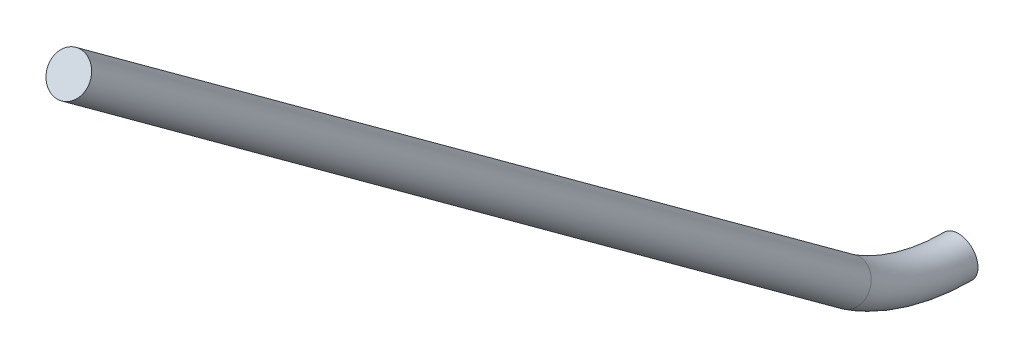
ISO-10303-21;
HEADER;
FILE_DESCRIPTION(('STEP AP214'),'2;1');
FILE_NAME('part.step','',(''),(''),'','','');
FILE_SCHEMA(('AUTOMOTIVE_DESIGN { 1 0 10303 214 1 1 1 1 }'));
ENDSEC;
DATA;
#1=APPLICATION_CONTEXT('core data for automotive mechanical design processes');
#2=APPLICATION_PROTOCOL_DEFINITION('international standard','automotive_design',2000,#1);
#3=PRODUCT_CONTEXT('',#1,'mechanical');
#4=PRODUCT('Part','Part','',(#3));
#5=PRODUCT_RELATED_PRODUCT_CATEGORY('part','',(#4));
#6=PRODUCT_DEFINITION_FORMATION('','',#4);
#7=PRODUCT_DEFINITION_CONTEXT('part definition',#1,'design');
#8=PRODUCT_DEFINITION('design','',#6,#7);
#9=PRODUCT_DEFINITION_SHAPE('','',#8);
#10=(LENGTH_UNIT() NAMED_UNIT(*) SI_UNIT(.MILLI.,.METRE.));
#11=(NAMED_UNIT(*) PLANE_ANGLE_UNIT() SI_UNIT($,.RADIAN.));
#12=(NAMED_UNIT(*) SI_UNIT($,.STERADIAN.) SOLID_ANGLE_UNIT());
#13=UNCERTAINTY_MEASURE_WITH_UNIT(LENGTH_MEASURE(1.E-05),#10,'distance_accuracy_value','');
#14=(GEOMETRIC_REPRESENTATION_CONTEXT(3) GLOBAL_UNCERTAINTY_ASSIGNED_CONTEXT((#13)) GLOBAL_UNIT_ASSIGNED_CONTEXT((#10,
#11,#12)) REPRESENTATION_CONTEXT('',''));
#15=CARTESIAN_POINT('',(0.,0.,0.));
#16=DIRECTION('',(0.,0.,1.));
#17=DIRECTION('',(1.,0.,0.));
#18=AXIS2_PLACEMENT_3D('',#15,#16,#17);
#19=CARTESIAN_POINT('',(0.,4.67024869867316,6.89631691869863));
#20=DIRECTION('',(0.,0.589979762523123,0.807418032875882));
#21=DIRECTION('',(1.,0.,0.));
#22=AXIS2_PLACEMENT_3D('',#19,#20,#21);
#23=PLANE('',#22);
#24=CARTESIAN_POINT('',(0.,4.67024869867316,6.89631691869863));
#25=DIRECTION('',(0.,0.589979762523123,0.807418032875882));
#26=DIRECTION('',(1.,0.,0.));
#27=AXIS2_PLACEMENT_3D('',#24,#25,#26);
#28=CIRCLE('',#27,0.1524);
#29=CARTESIAN_POINT('',(0.1524,4.67024869867316,6.89631691869863));
#30=VERTEX_POINT('',#29);
#31=EDGE_CURVE('E45',#30,#30,#28,.T.);
#32=ORIENTED_EDGE('',*,*,#31,.T.);
#33=EDGE_LOOP('',(#32));
#34=FACE_BOUND('',#33,.T.);
#35=ADVANCED_FACE('F33',(#34),#23,.T.);
#36=CARTESIAN_POINT('',(0.,0.,0.));
#37=DIRECTION('',(0.,0.,1.));
#38=DIRECTION('',(1.,0.,0.));
#39=AXIS2_PLACEMENT_3D('',#36,#37,#38);
#40=PLANE('',#39);
#41=CARTESIAN_POINT('',(0.,0.,0.));
#42=DIRECTION('',(0.,0.,1.));
#43=DIRECTION('',(1.,0.,0.));
#44=AXIS2_PLACEMENT_3D('',#41,#42,#43);
#45=CIRCLE('',#44,0.1524);
#46=CARTESIAN_POINT('',(0.1524,0.,0.));
#47=VERTEX_POINT('',#46);
#48=EDGE_CURVE('E40',#47,#47,#45,.T.);
#49=ORIENTED_EDGE('',*,*,#48,.F.);
#50=EDGE_LOOP('',(#49));
#51=FACE_BOUND('',#50,.T.);
#52=ADVANCED_FACE('F70',(#51),#40,.F.);
#53=CARTESIAN_POINT('',(0.,0.251489744147772,0.849015147604822));
#54=DIRECTION('',(0.,0.589979762523122,0.807418032875883));
#55=DIRECTION('',(0.,-0.807418032875883,0.589979762523122));
#56=AXIS2_PLACEMENT_3D('',#53,#54,#55);
#57=CYLINDRICAL_SURFACE('',#56,0.1524);
#58=ORIENTED_EDGE('',*,*,#31,.F.);
#59=EDGE_LOOP('',(#58));
#60=FACE_BOUND('',#59,.T.);
#61=CARTESIAN_POINT('',(0.,0.251489744147772,0.849015147604822));
#62=DIRECTION('',(0.,0.544639035015028,0.838670567945423));
#63=DIRECTION('',(1.,0.,0.));
#64=AXIS2_PLACEMENT_3D('',#61,#62,#63);
#65=CIRCLE('',#64,0.1524);
#66=CARTESIAN_POINT('',(0.1524,0.251489744147772,0.849015147604822));
#67=VERTEX_POINT('',#66);
#68=EDGE_CURVE('E10',#67,#67,#65,.T.);
#69=ORIENTED_EDGE('',*,*,#68,.T.);
#70=EDGE_LOOP('',(#69));
#71=FACE_BOUND('',#70,.T.);
#72=ADVANCED_FACE('F67',(#60,#71),#57,.T.);
#73=CARTESIAN_POINT('',(0.,1.5588584236923,0.));
#74=DIRECTION('',(-1.,0.,0.));
#75=DIRECTION('',(0.,0.,1.));
#76=AXIS2_PLACEMENT_3D('',#73,#74,#75);
#77=TOROIDAL_SURFACE('',#76,1.5588584236923,0.1524);
#78=ORIENTED_EDGE('',*,*,#68,.F.);
#79=EDGE_LOOP('',(#78));
#80=FACE_BOUND('',#79,.T.);
#81=ORIENTED_EDGE('',*,*,#48,.T.);
#82=EDGE_LOOP('',(#81));
#83=FACE_BOUND('',#82,.T.);
#84=ADVANCED_FACE('F58',(#80,#83),#77,.T.);
#85=CLOSED_SHELL('',(#35,#52,#72,#84));
#86=MANIFOLD_SOLID_BREP('B2',#85);
#87=ADVANCED_BREP_SHAPE_REPRESENTATION('',(#18,#86),#14);
#88=SHAPE_DEFINITION_REPRESENTATION(#9,#87);
ENDSEC;
END-ISO-10303-21;
